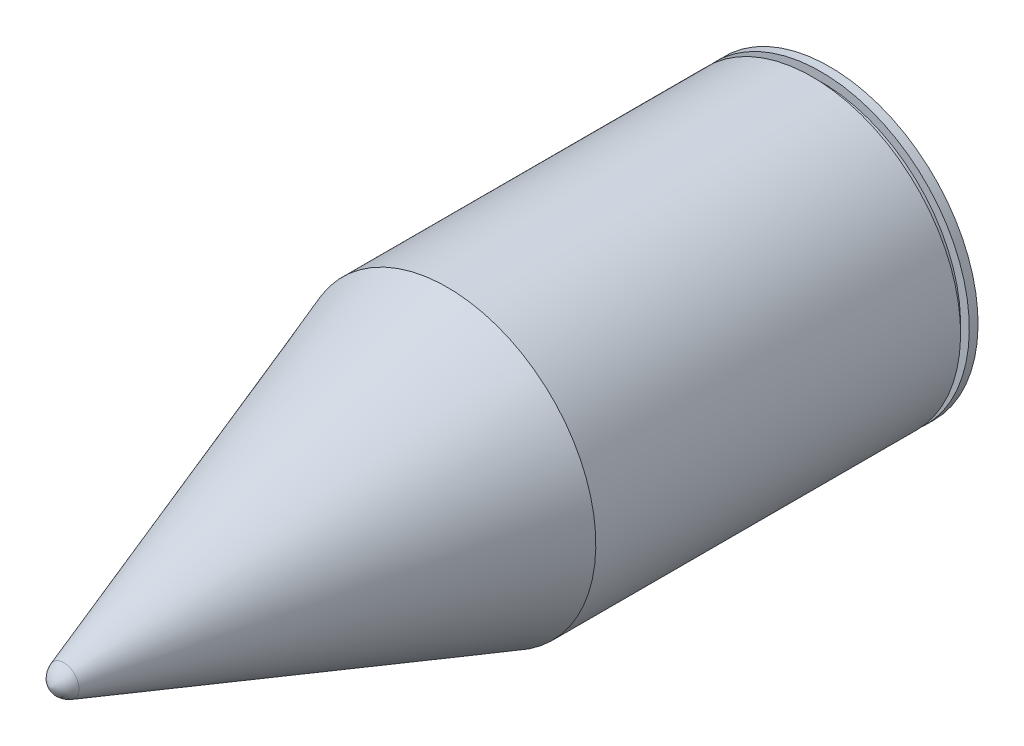
ISO-10303-21;
HEADER;
FILE_DESCRIPTION(('STEP AP214'),'2;1');
FILE_NAME('part.step','',(''),(''),'','','');
FILE_SCHEMA(('AUTOMOTIVE_DESIGN { 1 0 10303 214 1 1 1 1 }'));
ENDSEC;
DATA;
#1=APPLICATION_CONTEXT('core data for automotive mechanical design processes');
#2=APPLICATION_PROTOCOL_DEFINITION('international standard','automotive_design',2000,#1);
#3=PRODUCT_CONTEXT('',#1,'mechanical');
#4=PRODUCT('Part','Part','',(#3));
#5=PRODUCT_RELATED_PRODUCT_CATEGORY('part','',(#4));
#6=PRODUCT_DEFINITION_FORMATION('','',#4);
#7=PRODUCT_DEFINITION_CONTEXT('part definition',#1,'design');
#8=PRODUCT_DEFINITION('design','',#6,#7);
#9=PRODUCT_DEFINITION_SHAPE('','',#8);
#10=(LENGTH_UNIT() NAMED_UNIT(*) SI_UNIT(.MILLI.,.METRE.));
#11=(NAMED_UNIT(*) PLANE_ANGLE_UNIT() SI_UNIT($,.RADIAN.));
#12=(NAMED_UNIT(*) SI_UNIT($,.STERADIAN.) SOLID_ANGLE_UNIT());
#13=UNCERTAINTY_MEASURE_WITH_UNIT(LENGTH_MEASURE(1.E-05),#10,'distance_accuracy_value','');
#14=(GEOMETRIC_REPRESENTATION_CONTEXT(3) GLOBAL_UNCERTAINTY_ASSIGNED_CONTEXT((#13)) GLOBAL_UNIT_ASSIGNED_CONTEXT((#10,
#11,#12)) REPRESENTATION_CONTEXT('',''));
#15=CARTESIAN_POINT('',(0.,0.,0.));
#16=DIRECTION('',(0.,0.,1.));
#17=DIRECTION('',(1.,0.,0.));
#18=AXIS2_PLACEMENT_3D('',#15,#16,#17);
#19=CARTESIAN_POINT('',(0.,0.,0.));
#20=DIRECTION('',(0.,0.,1.));
#21=DIRECTION('',(0.,-1.,0.));
#22=AXIS2_PLACEMENT_3D('',#19,#20,#21);
#23=CYLINDRICAL_SURFACE('',#22,160.);
#24=CARTESIAN_POINT('',(0.,-5.83605595483389E-12,-871.999999999999));
#25=DIRECTION('',(0.,0.,1.));
#26=DIRECTION('',(0.,-1.,0.));
#27=AXIS2_PLACEMENT_3D('',#24,#25,#26);
#28=CIRCLE('',#27,160.);
#29=CARTESIAN_POINT('',(0.,-160.000000000006,-871.999999999998));
#30=VERTEX_POINT('',#29);
#31=EDGE_CURVE('E11',#30,#30,#28,.T.);
#32=ORIENTED_EDGE('',*,*,#31,.F.);
#33=EDGE_LOOP('',(#32));
#34=FACE_BOUND('',#33,.T.);
#35=CARTESIAN_POINT('',(0.,-5.90298320202236E-12,-881.999999999999));
#36=DIRECTION('',(0.,0.,1.));
#37=DIRECTION('',(0.,-1.,0.));
#38=AXIS2_PLACEMENT_3D('',#35,#36,#37);
#39=CIRCLE('',#38,160.);
#40=CARTESIAN_POINT('',(0.,-160.000000000006,-881.999999999998));
#41=VERTEX_POINT('',#40);
#42=EDGE_CURVE('E75',#41,#41,#39,.T.);
#43=ORIENTED_EDGE('',*,*,#42,.T.);
#44=EDGE_LOOP('',(#43));
#45=FACE_BOUND('',#44,.T.);
#46=ADVANCED_FACE('F33',(#34,#45),#23,.T.);
#47=CARTESIAN_POINT('',(0.,169.999999999994,-872.));
#48=DIRECTION('',(0.,0.,1.));
#49=DIRECTION('',(0.,-1.,0.));
#50=AXIS2_PLACEMENT_3D('',#47,#48,#49);
#51=PLANE('',#50);
#52=CARTESIAN_POINT('',(0.,-5.83605595483389E-12,-871.999999999999));
#53=DIRECTION('',(0.,0.,1.));
#54=DIRECTION('',(0.,-1.,0.));
#55=AXIS2_PLACEMENT_3D('',#52,#53,#54);
#56=CIRCLE('',#55,170.);
#57=CARTESIAN_POINT('',(0.,-170.000000000006,-871.999999999998));
#58=VERTEX_POINT('',#57);
#59=EDGE_CURVE('E39',#58,#58,#56,.T.);
#60=ORIENTED_EDGE('',*,*,#59,.F.);
#61=EDGE_LOOP('',(#60));
#62=FACE_BOUND('',#61,.T.);
#63=ORIENTED_EDGE('',*,*,#31,.T.);
#64=EDGE_LOOP('',(#63));
#65=FACE_BOUND('',#64,.T.);
#66=ADVANCED_FACE('F66',(#62,#65),#51,.F.);
#67=CARTESIAN_POINT('',(0.,0.,0.));
#68=DIRECTION('',(0.,0.,1.));
#69=DIRECTION('',(0.,-1.,0.));
#70=AXIS2_PLACEMENT_3D('',#67,#68,#69);
#71=CYLINDRICAL_SURFACE('',#70,169.999999999998);
#72=CARTESIAN_POINT('',(0.,-3.03971876329735E-12,-454.18254761588));
#73=DIRECTION('',(0.,0.,1.));
#74=DIRECTION('',(0.,-1.,0.));
#75=AXIS2_PLACEMENT_3D('',#72,#73,#74);
#76=CIRCLE('',#75,169.999999999997);
#77=CARTESIAN_POINT('',(0.,-170.,-454.182547615879));
#78=VERTEX_POINT('',#77);
#79=EDGE_CURVE('E52',#78,#78,#76,.T.);
#80=ORIENTED_EDGE('',*,*,#79,.F.);
#81=EDGE_LOOP('',(#80));
#82=FACE_BOUND('',#81,.T.);
#83=ORIENTED_EDGE('',*,*,#59,.T.);
#84=EDGE_LOOP('',(#83));
#85=FACE_BOUND('',#84,.T.);
#86=ADVANCED_FACE('F64',(#82,#85),#71,.T.);
#87=CARTESIAN_POINT('',(0.,-3.03971876329735E-12,-454.18254761588));
#88=DIRECTION('',(0.,0.,-1.));
#89=DIRECTION('',(0.,1.,0.));
#90=AXIS2_PLACEMENT_3D('',#87,#88,#89);
#91=CONICAL_SURFACE('',#90,169.999999999997,0.334531232019402);
#92=CARTESIAN_POINT('',(0.,0.,-14.8069411975454));
#93=DIRECTION('',(0.,0.,1.));
#94=DIRECTION('',(0.,-1.,0.));
#95=AXIS2_PLACEMENT_3D('',#92,#93,#94);
#96=CIRCLE('',#95,17.2749621826968);
#97=CARTESIAN_POINT('',(0.,-17.2749621826969,-14.8069411975453));
#98=VERTEX_POINT('',#97);
#99=EDGE_CURVE('E50',#98,#98,#96,.T.);
#100=ORIENTED_EDGE('',*,*,#99,.F.);
#101=EDGE_LOOP('',(#100));
#102=FACE_BOUND('',#101,.T.);
#103=ORIENTED_EDGE('',*,*,#79,.T.);
#104=EDGE_LOOP('',(#103));
#105=FACE_BOUND('',#104,.T.);
#106=ADVANCED_FACE('F46',(#102,#105),#91,.T.);
#107=CARTESIAN_POINT('',(0.,4.06673046228723,-22.2252201567717));
#108=DIRECTION('',(-1.,0.,0.));
#109=DIRECTION('',(0.,-1.,0.));
#110=AXIS2_PLACEMENT_3D('',#107,#108,#109);
#111=CIRCLE('',#110,22.5942184567174);
#112=TRIMMED_CURVE('',#111,(PARAMETER_VALUE(-1.38982017286535)),
(PARAMETER_VALUE(1.38982017286535)),.T.,.PARAMETER.);
#113=CARTESIAN_POINT('',(0.,-1.48318857196017E-13,-22.2252201567717));
#114=DIRECTION('',(0.,0.,1.));
#115=AXIS1_PLACEMENT('',#113,#114);
#116=SURFACE_OF_REVOLUTION('',#112,#115);
#117=CARTESIAN_POINT('',(0.,0.,0.));
#118=VERTEX_POINT('',#117);
#119=VERTEX_LOOP('',#118);
#120=FACE_BOUND('',#119,.T.);
#121=ORIENTED_EDGE('',*,*,#99,.T.);
#122=EDGE_LOOP('',(#121));
#123=FACE_BOUND('',#122,.T.);
#124=ADVANCED_FACE('F42',(#120,#123),#116,.T.);
#125=CARTESIAN_POINT('',(0.,154.999999999994,-902.000000000001));
#126=DIRECTION('',(0.,0.,1.));
#127=DIRECTION('',(0.,-1.,0.));
#128=AXIS2_PLACEMENT_3D('',#125,#126,#127);
#129=PLANE('',#128);
#130=CARTESIAN_POINT('',(0.,-6.03683769639928E-12,-901.999999999999));
#131=DIRECTION('',(0.,0.,1.));
#132=DIRECTION('',(0.,-1.,0.));
#133=AXIS2_PLACEMENT_3D('',#130,#131,#132);
#134=CIRCLE('',#133,155.);
#135=CARTESIAN_POINT('',(0.,-155.000000000006,-901.999999999998));
#136=VERTEX_POINT('',#135);
#137=EDGE_CURVE('E53',#136,#136,#134,.T.);
#138=ORIENTED_EDGE('',*,*,#137,.F.);
#139=EDGE_LOOP('',(#138));
#140=FACE_BOUND('',#139,.T.);
#141=ADVANCED_FACE('F45',(#140),#129,.F.);
#142=CARTESIAN_POINT('',(0.,0.,0.));
#143=DIRECTION('',(0.,0.,1.));
#144=DIRECTION('',(0.,-1.,0.));
#145=AXIS2_PLACEMENT_3D('',#142,#143,#144);
#146=CYLINDRICAL_SURFACE('',#145,155.);
#147=CARTESIAN_POINT('',(0.,-5.96991044921082E-12,-891.999999999999));
#148=DIRECTION('',(0.,0.,1.));
#149=DIRECTION('',(0.,-1.,0.));
#150=AXIS2_PLACEMENT_3D('',#147,#148,#149);
#151=CIRCLE('',#150,155.);
#152=CARTESIAN_POINT('',(0.,-155.000000000006,-891.999999999998));
#153=VERTEX_POINT('',#152);
#154=EDGE_CURVE('E58',#153,#153,#151,.T.);
#155=ORIENTED_EDGE('',*,*,#154,.F.);
#156=EDGE_LOOP('',(#155));
#157=FACE_BOUND('',#156,.T.);
#158=ORIENTED_EDGE('',*,*,#137,.T.);
#159=EDGE_LOOP('',(#158));
#160=FACE_BOUND('',#159,.T.);
#161=ADVANCED_FACE('F89',(#157,#160),#146,.T.);
#162=CARTESIAN_POINT('',(0.,169.999999999994,-892.));
#163=DIRECTION('',(0.,0.,1.));
#164=DIRECTION('',(0.,-1.,0.));
#165=AXIS2_PLACEMENT_3D('',#162,#163,#164);
#166=PLANE('',#165);
#167=CARTESIAN_POINT('',(0.,-5.96991044921082E-12,-891.999999999999));
#168=DIRECTION('',(0.,0.,1.));
#169=DIRECTION('',(0.,-1.,0.));
#170=AXIS2_PLACEMENT_3D('',#167,#168,#169);
#171=CIRCLE('',#170,170.);
#172=CARTESIAN_POINT('',(0.,-170.000000000006,-891.999999999998));
#173=VERTEX_POINT('',#172);
#174=EDGE_CURVE('E80',#173,#173,#171,.T.);
#175=ORIENTED_EDGE('',*,*,#174,.F.);
#176=EDGE_LOOP('',(#175));
#177=FACE_BOUND('',#176,.T.);
#178=ORIENTED_EDGE('',*,*,#154,.T.);
#179=EDGE_LOOP('',(#178));
#180=FACE_BOUND('',#179,.T.);
#181=ADVANCED_FACE('F87',(#177,#180),#166,.F.);
#182=CARTESIAN_POINT('',(0.,0.,0.));
#183=DIRECTION('',(0.,0.,1.));
#184=DIRECTION('',(0.,-1.,0.));
#185=AXIS2_PLACEMENT_3D('',#182,#183,#184);
#186=CYLINDRICAL_SURFACE('',#185,170.);
#187=CARTESIAN_POINT('',(0.,-5.90298320202236E-12,-881.999999999999));
#188=DIRECTION('',(0.,0.,1.));
#189=DIRECTION('',(0.,-1.,0.));
#190=AXIS2_PLACEMENT_3D('',#187,#188,#189);
#191=CIRCLE('',#190,170.);
#192=CARTESIAN_POINT('',(0.,-170.000000000006,-881.999999999998));
#193=VERTEX_POINT('',#192);
#194=EDGE_CURVE('E77',#193,#193,#191,.T.);
#195=ORIENTED_EDGE('',*,*,#194,.F.);
#196=EDGE_LOOP('',(#195));
#197=FACE_BOUND('',#196,.T.);
#198=ORIENTED_EDGE('',*,*,#174,.T.);
#199=EDGE_LOOP('',(#198));
#200=FACE_BOUND('',#199,.T.);
#201=ADVANCED_FACE('F138',(#197,#200),#186,.T.);
#202=CARTESIAN_POINT('',(0.,159.999999999994,-882.));
#203=DIRECTION('',(0.,0.,-1.));
#204=DIRECTION('',(0.,1.,0.));
#205=AXIS2_PLACEMENT_3D('',#202,#203,#204);
#206=PLANE('',#205);
#207=ORIENTED_EDGE('',*,*,#42,.F.);
#208=EDGE_LOOP('',(#207));
#209=FACE_BOUND('',#208,.T.);
#210=ORIENTED_EDGE('',*,*,#194,.T.);
#211=EDGE_LOOP('',(#210));
#212=FACE_BOUND('',#211,.T.);
#213=ADVANCED_FACE('F147',(#209,#212),#206,.F.);
#214=CLOSED_SHELL('',(#46,#66,#86,#106,#124,#141,#161,#181,#201,#213));
#215=MANIFOLD_SOLID_BREP('B2',#214);
#216=ADVANCED_BREP_SHAPE_REPRESENTATION('',(#18,#215),#14);
#217=SHAPE_DEFINITION_REPRESENTATION(#9,#216);
ENDSEC;
END-ISO-10303-21;
